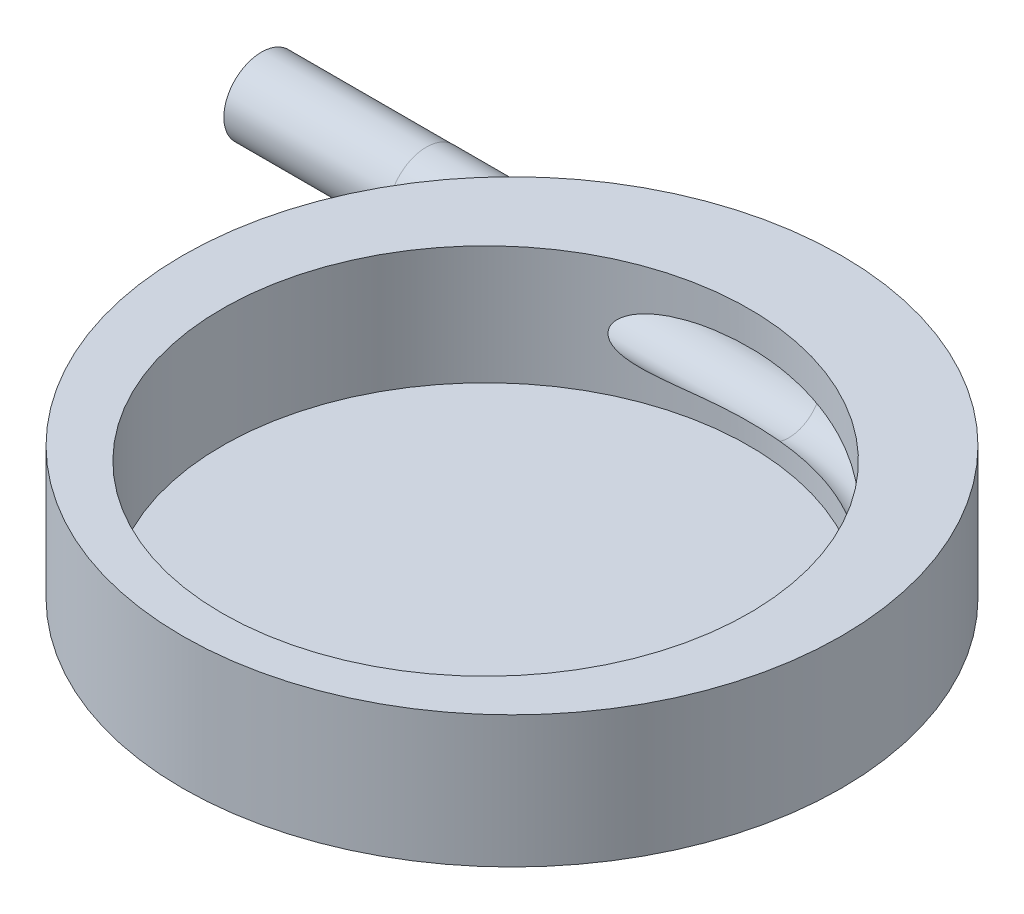
ISO-10303-21;
HEADER;
FILE_DESCRIPTION(('STEP AP214'),'2;1');
FILE_NAME('part.step','',(''),(''),'','','');
FILE_SCHEMA(('AUTOMOTIVE_DESIGN { 1 0 10303 214 1 1 1 1 }'));
ENDSEC;
DATA;
#1=APPLICATION_CONTEXT('core data for automotive mechanical design processes');
#2=APPLICATION_PROTOCOL_DEFINITION('international standard','automotive_design',2000,#1);
#3=PRODUCT_CONTEXT('',#1,'mechanical');
#4=PRODUCT('Part','Part','',(#3));
#5=PRODUCT_RELATED_PRODUCT_CATEGORY('part','',(#4));
#6=PRODUCT_DEFINITION_FORMATION('','',#4);
#7=PRODUCT_DEFINITION_CONTEXT('part definition',#1,'design');
#8=PRODUCT_DEFINITION('design','',#6,#7);
#9=PRODUCT_DEFINITION_SHAPE('','',#8);
#10=(LENGTH_UNIT() NAMED_UNIT(*) SI_UNIT(.MILLI.,.METRE.));
#11=(NAMED_UNIT(*) PLANE_ANGLE_UNIT() SI_UNIT($,.RADIAN.));
#12=(NAMED_UNIT(*) SI_UNIT($,.STERADIAN.) SOLID_ANGLE_UNIT());
#13=UNCERTAINTY_MEASURE_WITH_UNIT(LENGTH_MEASURE(1.E-05),#10,'distance_accuracy_value','');
#14=(GEOMETRIC_REPRESENTATION_CONTEXT(3) GLOBAL_UNCERTAINTY_ASSIGNED_CONTEXT((#13)) GLOBAL_UNIT_ASSIGNED_CONTEXT((#10,
#11,#12)) REPRESENTATION_CONTEXT('',''));
#15=CARTESIAN_POINT('',(0.,0.,0.));
#16=DIRECTION('',(0.,0.,1.));
#17=DIRECTION('',(1.,0.,0.));
#18=AXIS2_PLACEMENT_3D('',#15,#16,#17);
#19=CARTESIAN_POINT('',(0.,20.,4.));
#20=DIRECTION('',(0.,-1.,0.));
#21=DIRECTION('',(0.,0.,-1.));
#22=AXIS2_PLACEMENT_3D('',#19,#20,#21);
#23=CYLINDRICAL_SURFACE('',#22,40.);
#24=CARTESIAN_POINT('',(0.,2.,4.));
#25=DIRECTION('',(0.,1.,0.));
#26=DIRECTION('',(0.,0.,1.));
#27=AXIS2_PLACEMENT_3D('',#24,#25,#26);
#28=CIRCLE('',#27,40.);
#29=CARTESIAN_POINT('',(0.,2.,44.));
#30=VERTEX_POINT('',#29);
#31=EDGE_CURVE('E123',#30,#30,#28,.T.);
#32=ORIENTED_EDGE('',*,*,#31,.F.);
#33=EDGE_LOOP('',(#32));
#34=FACE_BOUND('',#33,.T.);
#35=CARTESIAN_POINT('',(0.,20.,4.));
#36=DIRECTION('',(0.,1.,0.));
#37=DIRECTION('',(0.,0.,1.));
#38=AXIS2_PLACEMENT_3D('',#35,#36,#37);
#39=CIRCLE('',#38,40.);
#40=CARTESIAN_POINT('',(0.,20.,44.));
#41=VERTEX_POINT('',#40);
#42=EDGE_CURVE('E114',#41,#41,#39,.T.);
#43=ORIENTED_EDGE('',*,*,#42,.T.);
#44=EDGE_LOOP('',(#43));
#45=FACE_BOUND('',#44,.T.);
#46=DIRECTION('',(0.,-1.,0.));
#47=VECTOR('',#46,1.);
#48=CARTESIAN_POINT('',(32.6655335644082,20.,27.0859896247165));
#49=LINE('',#48,#47);
#50=CARTESIAN_POINT('',(32.6655335644082,14.2592599935845,27.0859896247165));
#51=VERTEX_POINT('',#50);
#52=CARTESIAN_POINT('',(32.6655335644082,5.84841239569503,27.0859896247165));
#53=VERTEX_POINT('',#52);
#54=EDGE_CURVE('E63',#51,#53,#49,.T.);
#55=ORIENTED_EDGE('',*,*,#54,.T.);
#56=CARTESIAN_POINT('',(31.455499464649,6.09002957114624,28.7093414203913));
#57=CARTESIAN_POINT('',(31.7137638182249,6.03556428410288,28.380573265437));
#58=CARTESIAN_POINT('',(31.9670967603697,5.98402529520093,28.0474569651805));
#59=CARTESIAN_POINT('',(32.4635374641398,5.88632855148393,27.3729328838452));
#60=CARTESIAN_POINT('',(32.7066455089348,5.84017064758154,27.0315253327991));
#61=CARTESIAN_POINT('',(33.182221566403,5.75277402992615,26.3409023687803));
#62=CARTESIAN_POINT('',(33.414692550602,5.71153393711874,25.9916891774395));
#63=CARTESIAN_POINT('',(33.8687459495336,5.63360136379022,25.2857749765452));
#64=CARTESIAN_POINT('',(34.0903282616412,5.59690892612551,24.929073896464));
#65=CARTESIAN_POINT('',(34.7384863356481,5.49315106971563,23.848011000019));
#66=CARTESIAN_POINT('',(35.1483339118309,5.43243026716021,23.1128917883856));
#67=CARTESIAN_POINT('',(35.9212652435493,5.32597487652627,21.6173692515045));
#68=CARTESIAN_POINT('',(36.2843399030624,5.28024320075085,20.8569610443218));
#69=CARTESIAN_POINT('',(37.0653567279209,5.19036818422055,19.0787205143414));
#70=CARTESIAN_POINT('',(37.4662646611111,5.15096237776326,18.0531031300035));
#71=CARTESIAN_POINT('',(38.1823254092484,5.09237225742284,15.9717085025345));
#72=CARTESIAN_POINT('',(38.497464476332,5.07319118394102,14.9159264542526));
#73=CARTESIAN_POINT('',(39.0397201688759,5.05266020746107,12.7814083242282));
#74=CARTESIAN_POINT('',(39.2668048932623,5.05131676098126,11.7026640725723));
#75=CARTESIAN_POINT('',(39.6311643969804,5.06418109151128,9.53026613478107));
#76=CARTESIAN_POINT('',(39.7684427124175,5.07838825616074,8.43661303740898));
#77=CARTESIAN_POINT('',(39.9524259619792,5.12003661492655,6.24044470731463));
#78=CARTESIAN_POINT('',(39.9990050142957,5.14749613621323,5.13791928723124));
#79=CARTESIAN_POINT('',(40.0009634554894,5.21314380968361,2.93310770756898));
#80=CARTESIAN_POINT('',(39.9563419890983,5.25133206247725,1.83082155033083));
#81=CARTESIAN_POINT('',(39.7762750228464,5.33568767524298,-0.366093881108271));
#82=CARTESIAN_POINT('',(39.6408212690112,5.38185576006329,-1.46072245032568));
#83=CARTESIAN_POINT('',(39.2800629060936,5.47911934485887,-3.63485088651306));
#84=CARTESIAN_POINT('',(39.0547573489435,5.53021489682181,-4.71435059372701));
#85=CARTESIAN_POINT('',(38.5113009808996,5.63484177351839,-6.86898255949879));
#86=CARTESIAN_POINT('',(38.19165246158,5.68839961064399,-7.94373605247632));
#87=CARTESIAN_POINT('',(37.4632448095182,5.79329851080853,-10.0627346596424));
#88=CARTESIAN_POINT('',(37.0544844918094,5.84463954435858,-11.1069793679301));
#89=CARTESIAN_POINT('',(36.1506775527344,5.94110999046968,-13.1576181043705));
#90=CARTESIAN_POINT('',(35.6556396395484,5.98624002909765,-14.1640159400365));
#91=CARTESIAN_POINT('',(34.5826307514606,6.06643740246129,-16.1320069928989));
#92=CARTESIAN_POINT('',(34.0046604505075,6.10150481896374,-17.0936005741122));
#93=CARTESIAN_POINT('',(32.7683314587671,6.15836183447038,-18.9673521888536));
#94=CARTESIAN_POINT('',(32.1097855617492,6.18011977982464,-19.8793877061389));
#95=CARTESIAN_POINT('',(30.7180980382736,6.20803150005458,-21.6449198845979));
#96=CARTESIAN_POINT('',(29.9849561252803,6.21418521498944,-22.4984163208923));
#97=CARTESIAN_POINT('',(28.4493280644015,6.21024439426546,-24.1407128015606));
#98=CARTESIAN_POINT('',(27.646833567587,6.20014789975868,-24.9295050342539));
#99=CARTESIAN_POINT('',(25.9784730322324,6.16475404791085,-26.4365331700596));
#100=CARTESIAN_POINT('',(25.1126083384695,6.13945701305796,-27.154770569657));
#101=CARTESIAN_POINT('',(23.3344773074808,6.0765578106227,-28.5074636852177));
#102=CARTESIAN_POINT('',(22.4228879239243,6.03910607215151,-29.1428168406305));
#103=CARTESIAN_POINT('',(20.5502622876816,5.95518842771907,-30.3353897218501));
#104=CARTESIAN_POINT('',(19.5892226326327,5.9087219008958,-30.8926040615628));
#105=CARTESIAN_POINT('',(17.6249559695141,5.8106165425173,-31.9248013636363));
#106=CARTESIAN_POINT('',(16.6217534130229,5.75898068544484,-32.3998311912971));
#107=CARTESIAN_POINT('',(14.5795858366406,5.65437912642343,-33.2647900956908));
#108=CARTESIAN_POINT('',(13.5406311931107,5.60141381151183,-33.6547436270114));
#109=CARTESIAN_POINT('',(11.8784387184349,5.51966449516818,-34.2009681152913));
#110=CARTESIAN_POINT('',(11.2646699187183,5.49010292968124,-34.3864333886334));
#111=CARTESIAN_POINT('',(10.0288784386628,5.43241172436864,-34.7276690724235));
#112=CARTESIAN_POINT('',(9.40685645737923,5.40428196423102,-34.8834419808954));
#113=CARTESIAN_POINT('',(8.15708952890347,5.35013219137862,-35.1646701217404));
#114=CARTESIAN_POINT('',(7.52935684915671,5.32410848468792,-35.2901792370926));
#115=CARTESIAN_POINT('',(6.268346315261,5.27468847471987,-35.5109843806938));
#116=CARTESIAN_POINT('',(5.63506719658455,5.25129278834781,-35.6062733245479));
#117=CARTESIAN_POINT('',(4.9998,5.22950423935838,-35.6862948630884));
#118=B_SPLINE_CURVE_WITH_KNOTS('',3,(#56,#57,#58,#59,#60,#61,#62,#63,#64,#65,#66,#67,#68,#69,
#70,#71,#72,#73,#74,#75,#76,#77,#78,#79,#80,#81,#82,#83,#84,#85,#86,#87,#88,#89,#90,#91,#92,#93,
#94,#95,#96,#97,#98,#99,#100,#101,#102,#103,#104,#105,#106,#107,#108,#109,#110,#111,#112,#113,
#114,#115,#116,#117),.UNSPECIFIED.,.F.,.F.,(4,2,2,2,2,2,2,2,2,2,2,2,2,2,2,2,2,2,2,2,2,2,2,2,2,2,
2,2,2,2,4),(0.,1.26475716847863,2.52947928750017,3.79384591450532,5.05822445580367,
7.58772076199819,10.1177082441748,13.4192477708495,16.7213161889619,20.0245797931958,
23.3277133244072,26.6354280271437,29.9431737493991,33.2512200888683,36.5593013339857,
39.9230164744411,43.2867763467223,46.6501969040165,50.0135901300788,53.3849516590672,
56.7563261385075,60.1281070437581,63.4998164172732,66.8312938591866,70.1630008264626,
73.4928015974218,76.8216439756564,78.7465792193616,80.6713524463751,82.5926729915597,
84.5144436119406),.UNSPECIFIED.);
#119=CARTESIAN_POINT('',(5.,5.22951110096639,-35.6862696659689));
#120=VERTEX_POINT('',#119);
#121=EDGE_CURVE('E11',#53,#120,#118,.T.);
#122=ORIENTED_EDGE('',*,*,#121,.T.);
#123=CARTESIAN_POINT('',(5.,5.22951110096639,-35.6862696659689));
#124=CARTESIAN_POINT('',(4.7918612722749,5.22237349455055,-35.7124927621041));
#125=CARTESIAN_POINT('',(4.58349834277701,5.21590384221301,-35.7370805023517));
#126=CARTESIAN_POINT('',(4.16638049507971,5.20415338378429,-35.782977472494));
#127=CARTESIAN_POINT('',(3.9576255813325,5.19887256427161,-35.8042867394007));
#128=CARTESIAN_POINT('',(3.33087378689882,5.18459308269134,-35.8632837664194));
#129=CARTESIAN_POINT('',(2.91236656806309,5.17715663240526,-35.8960436866062));
#130=CARTESIAN_POINT('',(2.07433213005047,5.16560339205537,-35.9483852745259));
#131=CARTESIAN_POINT('',(1.65480458102505,5.16148787726551,-35.9679618792508));
#132=CARTESIAN_POINT('',(0.815318450886483,5.15608895544674,-35.9938946037448));
#133=CARTESIAN_POINT('',(0.395359866789346,5.15480556815834,-36.0002506313637));
#134=CARTESIAN_POINT('',(-0.447690102028197,5.15491133088943,-35.9997323151337));
#135=CARTESIAN_POINT('',(-0.870781421410384,5.15632054486301,-35.9927586447167));
#136=CARTESIAN_POINT('',(-1.71651176342396,5.16202843935936,-35.9653923717726));
#137=CARTESIAN_POINT('',(-2.13915078582828,5.16632712133199,-35.9449997625125));
#138=CARTESIAN_POINT('',(-2.9834075754426,5.17833555973446,-35.8908280082774));
#139=CARTESIAN_POINT('',(-3.40502558696529,5.18604439751033,-35.8570524687544));
#140=CARTESIAN_POINT('',(-4.2468728140845,5.20574849033043,-35.7761595150725));
#141=CARTESIAN_POINT('',(-4.66710207935587,5.21774359034472,-35.7290425834715));
#142=CARTESIAN_POINT('',(-5.3973265510338,5.2434682497111,-35.6354280330947));
#143=CARTESIAN_POINT('',(-5.70775155643856,5.25594902140529,-35.5919154620549));
#144=CARTESIAN_POINT('',(-6.32732224730613,5.28462957106812,-35.4976350395051));
#145=CARTESIAN_POINT('',(-6.63646796698945,5.30082924889389,-35.4468673833742));
#146=CARTESIAN_POINT('',(-7.25333478897804,5.33775348608345,-35.3381145574421));
#147=CARTESIAN_POINT('',(-7.56105533685159,5.35847967642574,-35.2801267893592));
#148=CARTESIAN_POINT('',(-8.17465209978201,5.40541693344138,-35.1570296574981));
#149=CARTESIAN_POINT('',(-8.48052832900224,5.43162795793884,-35.0919203484833));
#150=CARTESIAN_POINT('',(-9.08964538910527,5.49064836428869,-34.9547899967761));
#151=CARTESIAN_POINT('',(-9.39288929121605,5.52344852748989,-34.8827786832492));
#152=CARTESIAN_POINT('',(-9.9967295616706,5.59705513050567,-34.7319279176206));
#153=CARTESIAN_POINT('',(-10.2973257619661,5.63786207473479,-34.6530880355047));
#154=CARTESIAN_POINT('',(-10.8949911020888,5.72911919742176,-34.4888960329679));
#155=CARTESIAN_POINT('',(-11.192063074432,5.77956098287519,-34.4035496190474));
#156=CARTESIAN_POINT('',(-11.7820832378703,5.89215731199186,-34.2266572267951));
#157=CARTESIAN_POINT('',(-12.0750322226162,5.95430956737891,-34.1351124618827));
#158=CARTESIAN_POINT('',(-12.6575460777073,6.09334033337308,-33.9457627586321));
#159=CARTESIAN_POINT('',(-12.9470779714182,6.17030921082371,-33.8479219932769));
#160=CARTESIAN_POINT('',(-13.519391297943,6.34212491041185,-33.6472831808798));
#161=CARTESIAN_POINT('',(-13.8021685338998,6.43698253769529,-33.5444821658254));
#162=CARTESIAN_POINT('',(-14.2188249701166,6.59588242449453,-33.38779304927));
#163=CARTESIAN_POINT('',(-14.3563820216895,6.65158120889534,-33.3351796772845));
#164=CARTESIAN_POINT('',(-14.6285608357009,6.76922494076743,-33.2293768329191));
#165=CARTESIAN_POINT('',(-14.7631831144992,6.83116877848494,-33.1761874643887));
#166=CARTESIAN_POINT('',(-15.0286871810201,6.96199871224174,-33.0696505626497));
#167=CARTESIAN_POINT('',(-15.1595742024028,7.03087441381201,-33.0163033793333));
#168=CARTESIAN_POINT('',(-15.4170146488159,7.17658013840478,-32.9098233569042));
#169=CARTESIAN_POINT('',(-15.5435669739438,7.25341216068618,-32.8566905751679));
#170=CARTESIAN_POINT('',(-15.792799759924,7.41713741658756,-32.7505925073731));
#171=CARTESIAN_POINT('',(-15.9154077570528,7.50414929453955,-32.6976385389749));
#172=CARTESIAN_POINT('',(-16.1532834742028,7.68857760905998,-32.5935549480195));
#173=CARTESIAN_POINT('',(-16.2685564792744,7.78598641571735,-32.5424240238639));
#174=CARTESIAN_POINT('',(-16.4888890296486,7.99190420344074,-32.4435319158659));
#175=CARTESIAN_POINT('',(-16.5940095561549,8.10033767745195,-32.3957511554212));
#176=CARTESIAN_POINT('',(-16.7916225046507,8.32983335615583,-32.305002430686));
#177=CARTESIAN_POINT('',(-16.884136278057,8.45087358004431,-32.2620263516954));
#178=CARTESIAN_POINT('',(-17.0419774217572,8.6903277615489,-32.1880870856695));
#179=CARTESIAN_POINT('',(-17.1092573897645,8.80717993903787,-32.1562938431099));
#180=CARTESIAN_POINT('',(-17.2275479685499,9.05065217533901,-32.1000816388443));
#181=CARTESIAN_POINT('',(-17.2785612639968,9.17727061802816,-32.0756614603156));
#182=CARTESIAN_POINT('',(-17.3609409631706,9.43957408143645,-32.036091301268));
#183=CARTESIAN_POINT('',(-17.3921259360864,9.57533060252291,-32.0210269556424));
#184=CARTESIAN_POINT('',(-17.4310319022887,9.85091675765361,-32.0022170569013));
#185=CARTESIAN_POINT('',(-17.438774571817,9.99074250814386,-31.9984610473985));
#186=CARTESIAN_POINT('',(-17.4304021198756,10.2571388573262,-32.0025147985362));
#187=CARTESIAN_POINT('',(-17.4163226492954,10.3837950506139,-32.0093377366216));
#188=CARTESIAN_POINT('',(-17.3692942646702,10.6326932230259,-32.0320452044442));
#189=CARTESIAN_POINT('',(-17.336334527821,10.754932627536,-32.0479349315498));
#190=CARTESIAN_POINT('',(-17.2429961523959,11.0242061259957,-32.0926918065307));
#191=CARTESIAN_POINT('',(-17.177637138452,11.1691079372186,-32.1238953694882));
#192=CARTESIAN_POINT('',(-17.026444211952,11.4453558876673,-32.195402323873));
#193=CARTESIAN_POINT('',(-16.9405698347045,11.5766744923309,-32.2357236908308));
#194=CARTESIAN_POINT('',(-16.7751289006932,11.7968538977625,-32.3125512777382));
#195=CARTESIAN_POINT('',(-16.6986493999812,11.8885358867878,-32.3478041558169));
#196=CARTESIAN_POINT('',(-16.5384315173941,12.0642266252201,-32.4209834669588));
#197=CARTESIAN_POINT('',(-16.4546890070312,12.1482309539853,-32.4589114182866));
#198=CARTESIAN_POINT('',(-16.2813202017545,12.3091882465471,-32.5366617427064));
#199=CARTESIAN_POINT('',(-16.1916861069029,12.3861315257466,-32.5764866071371));
#200=CARTESIAN_POINT('',(-16.0077111482297,12.5334902851264,-32.6573772566937));
#201=CARTESIAN_POINT('',(-15.9133684707313,12.6039032195962,-32.6984435175477));
#202=CARTESIAN_POINT('',(-15.6356148278603,12.7985361696873,-32.8180181841585));
#203=CARTESIAN_POINT('',(-15.4473035109042,12.9151957985383,-32.8974835951655));
#204=CARTESIAN_POINT('',(-15.0610654052316,13.1310634162397,-33.056822745545));
#205=CARTESIAN_POINT('',(-14.8631299396533,13.2302552698721,-33.1366967930377));
#206=CARTESIAN_POINT('',(-14.4597740805805,13.4142296798113,-33.2956033196261));
#207=CARTESIAN_POINT('',(-14.254337274472,13.4989780167282,-33.374633395484));
#208=CARTESIAN_POINT('',(-13.8381948053289,13.6560888760679,-33.5307044739247));
#209=CARTESIAN_POINT('',(-13.6274909596636,13.7284556049068,-33.607746144447));
#210=CARTESIAN_POINT('',(-13.1192274438175,13.8888341050218,-33.7886775707424));
#211=CARTESIAN_POINT('',(-12.819719531894,13.9720050714663,-33.8913726383673));
#212=CARTESIAN_POINT('',(-12.2146532849116,14.1222142340456,-34.0907316874047));
#213=CARTESIAN_POINT('',(-11.9090924286439,14.1892455478893,-34.1873930829628));
#214=CARTESIAN_POINT('',(-11.2928931066802,14.3102707070694,-34.3741368619117));
#215=CARTESIAN_POINT('',(-10.982247310329,14.3642435573218,-34.4642084903843));
#216=CARTESIAN_POINT('',(-10.3573661865615,14.4614217919252,-34.6371591745254));
#217=CARTESIAN_POINT('',(-10.0431313715418,14.5046286936987,-34.7200392427446));
#218=CARTESIAN_POINT('',(-9.40971243209263,14.5824747702392,-34.8788452359703));
#219=CARTESIAN_POINT('',(-9.09050953007372,14.6170576041668,-34.9547234902153));
#220=CARTESIAN_POINT('',(-8.44966094013839,14.6789123430077,-35.0987352408136));
#221=CARTESIAN_POINT('',(-8.12801519292251,14.7061840698586,-35.1668685485151));
#222=CARTESIAN_POINT('',(-7.48295294615581,14.7547287988444,-35.2952093861595));
#223=CARTESIAN_POINT('',(-7.15953794412355,14.7760062543278,-35.3554227822492));
#224=CARTESIAN_POINT('',(-6.51104033211895,14.8136851489407,-35.4678941334582));
#225=CARTESIAN_POINT('',(-6.18595765844042,14.8300864003635,-35.5201517822878));
#226=CARTESIAN_POINT('',(-5.40743680755072,14.8645465275591,-35.6354523828349));
#227=CARTESIAN_POINT('',(-4.95335923377814,14.8807595437302,-35.6947593979804));
#228=CARTESIAN_POINT('',(-4.04325935650548,14.9074369931035,-35.7977613441856));
#229=CARTESIAN_POINT('',(-3.5872369530195,14.9179011270695,-35.841455462534));
#230=CARTESIAN_POINT('',(-2.67367787764401,14.9344268153235,-35.9131741555809));
#231=CARTESIAN_POINT('',(-2.21614061925264,14.9404863966115,-35.9411917067376));
#232=CARTESIAN_POINT('',(-1.30034212745737,14.9490432018165,-35.9814856076023));
#233=CARTESIAN_POINT('',(-0.842080894023172,14.9515404255844,-35.9937619566516));
#234=CARTESIAN_POINT('',(0.066187403927446,14.9533222271894,-36.00247583041));
#235=CARTESIAN_POINT('',(0.516191621235743,14.9526649177895,-35.99919987162));
#236=CARTESIAN_POINT('',(1.41581185950042,14.9481747864041,-35.9774677418181));
#237=CARTESIAN_POINT('',(1.86542788377269,14.9443419918174,-35.9590117017824));
#238=CARTESIAN_POINT('',(2.76345409283685,14.9329733611831,-35.9069600994336));
#239=CARTESIAN_POINT('',(3.21186487276616,14.925439941529,-35.873374417493));
#240=CARTESIAN_POINT('',(3.88335161260795,14.9106191580031,-35.811683150875));
#241=CARTESIAN_POINT('',(4.10699929580366,14.9050918922035,-35.7892330550506));
#242=CARTESIAN_POINT('',(4.55385025068135,14.8926852697667,-35.7405706988451));
#243=CARTESIAN_POINT('',(4.77705351641672,14.8858058951585,-35.7143583884617));
#244=CARTESIAN_POINT('',(5.,14.8781612883131,-35.6862696659689));
#245=B_SPLINE_CURVE_WITH_KNOTS('',3,(#123,#124,#125,#126,#127,#128,#129,#130,#131,#132,#133,
#134,#135,#136,#137,#138,#139,#140,#141,#142,#143,#144,#145,#146,#147,#148,#149,#150,#151,#152,
#153,#154,#155,#156,#157,#158,#159,#160,#161,#162,#163,#164,#165,#166,#167,#168,#169,#170,#171,
#172,#173,#174,#175,#176,#177,#178,#179,#180,#181,#182,#183,#184,#185,#186,#187,#188,#189,#190,
#191,#192,#193,#194,#195,#196,#197,#198,#199,#200,#201,#202,#203,#204,#205,#206,#207,#208,#209,
#210,#211,#212,#213,#214,#215,#216,#217,#218,#219,#220,#221,#222,#223,#224,#225,#226,#227,#228,
#229,#230,#231,#232,#233,#234,#235,#236,#237,#238,#239,#240,#241,#242,#243,#244),.UNSPECIFIED.,
.F.,.F.,(4,2,2,2,2,2,2,2,2,2,2,2,2,2,2,2,2,2,2,2,2,2,2,2,2,2,2,2,2,2,2,2,2,2,2,2,2,2,2,2,2,2,2,
2,2,2,2,2,2,2,2,2,2,2,2,2,2,2,2,2,4),(0.,0.629700108842379,1.25939310823305,2.51870869760029,
3.77850764749421,5.03831537841799,6.30754720549763,7.57677966943857,8.84567042580073,
10.1145152922627,11.0555412164073,11.9965418035375,12.9378820100307,13.8792149783101,
14.8192400169535,15.759324294713,16.6985933600902,17.637679078241,18.5826849602734,
19.5282634827762,20.0005105617088,20.4726738691684,20.9441394189301,21.4157237270379,
21.893487407254,22.3709028546284,22.8452444406298,23.3187723993229,23.7331297601592,
24.1474186995825,24.5654458423085,24.9830863323723,25.3640464067593,25.7452250791324,
26.2285365740185,26.7128093440579,27.0857708873576,27.4589458390679,27.8326252002505,
28.2064496251082,28.9112694934263,29.6167370367303,30.3238534056144,31.0307290660733,
32.0121637405294,32.9940161813574,33.9774368842589,34.9607188989586,35.9502656296104,
36.9398364585335,37.9286701510248,38.9175419031803,40.2918695706099,41.6662687666644,
43.041283240072,44.4162977710202,45.7660800885923,47.1158507601331,48.4647412424989,
49.1392288637232,49.8137254501901),.UNSPECIFIED.);
#246=CARTESIAN_POINT('',(5.,14.8781612883131,-35.6862696659689));
#247=VERTEX_POINT('',#246);
#248=EDGE_CURVE('E95',#120,#247,#245,.T.);
#249=ORIENTED_EDGE('',*,*,#248,.T.);
#250=CARTESIAN_POINT('',(4.9998,14.8781681499211,-35.6862948630884));
#251=CARTESIAN_POINT('',(5.83453163203319,14.8495490724872,-35.5811680144738));
#252=CARTESIAN_POINT('',(6.66582411472633,14.8181394518703,-35.4496517915199));
#253=CARTESIAN_POINT('',(8.31814228852175,14.751094499278,-35.1345753227867));
#254=CARTESIAN_POINT('',(9.13917001788232,14.7154600214465,-34.9510255862774));
#255=CARTESIAN_POINT('',(10.7690069579401,14.6412581350124,-34.5322919161974));
#256=CARTESIAN_POINT('',(11.5777982158994,14.6026868394809,-34.2970387476947));
#257=CARTESIAN_POINT('',(13.1789696353166,14.5241389482275,-33.7759685914387));
#258=CARTESIAN_POINT('',(13.9713468291494,14.4841621018492,-33.4901425478331));
#259=CARTESIAN_POINT('',(15.7971654946876,14.3911011821734,-32.7655913789797));
#260=CARTESIAN_POINT('',(16.8230488745312,14.3380838190335,-32.3076414590206));
#261=CARTESIAN_POINT('',(18.832955187396,14.2363183172033,-31.3069476584457));
#262=CARTESIAN_POINT('',(19.8169707935385,14.1875709241923,-30.7641890132857));
#263=CARTESIAN_POINT('',(21.7362251228404,14.0983416702505,-29.5975832656939));
#264=CARTESIAN_POINT('',(22.6714604598615,14.0578603825539,-28.9737305444927));
#265=CARTESIAN_POINT('',(24.4863563591899,13.9888182378536,-27.6493327755268));
#266=CARTESIAN_POINT('',(25.3660198631229,13.9602567494408,-26.948791792533));
#267=CARTESIAN_POINT('',(27.0622351569431,13.9178759290643,-25.4770146008252));
#268=CARTESIAN_POINT('',(27.8788764098546,13.9040353293058,-24.7058821335548));
#269=CARTESIAN_POINT('',(29.4445003719106,13.8924481152477,-23.0976166307321));
#270=CARTESIAN_POINT('',(30.1934824400999,13.8947016533965,-22.2604829700716));
#271=CARTESIAN_POINT('',(31.6183548531988,13.9150678681696,-20.5262945456405));
#272=CARTESIAN_POINT('',(32.2942421229083,13.9331812117465,-19.6292372633657));
#273=CARTESIAN_POINT('',(33.5680486676432,13.9834238624653,-17.7817597728242));
#274=CARTESIAN_POINT('',(34.1659680869006,14.0155531436787,-16.8313396632774));
#275=CARTESIAN_POINT('',(35.2740134062004,14.0903744312552,-14.8938299182937));
#276=CARTESIAN_POINT('',(35.7849671940703,14.1329561555981,-13.9072091975542));
#277=CARTESIAN_POINT('',(36.7229513940983,14.225185371532,-11.895183351073));
#278=CARTESIAN_POINT('',(37.149982380481,14.2748328147734,-10.869778490761));
#279=CARTESIAN_POINT('',(37.9172886448653,14.3773187228365,-8.78713422212834));
#280=CARTESIAN_POINT('',(38.2575615276457,14.4301572757087,-7.72989393579463));
#281=CARTESIAN_POINT('',(38.8490530786807,14.5352403957119,-5.59075295757451));
#282=CARTESIAN_POINT('',(39.1002709817024,14.587484957735,-4.50885205386898));
#283=CARTESIAN_POINT('',(39.5146219800845,14.6885161544123,-2.31338852657617));
#284=CARTESIAN_POINT('',(39.6765553242785,14.7372483853697,-1.19959670480031));
#285=CARTESIAN_POINT('',(39.9060319320995,14.8271600601964,1.03799112861529));
#286=CARTESIAN_POINT('',(39.9735738853708,14.8683393992084,2.16178727891871));
#287=CARTESIAN_POINT('',(40.0137050604424,14.940154048623,4.41160595240465));
#288=CARTESIAN_POINT('',(39.9862786949799,14.9707876272303,5.53762881074484));
#289=CARTESIAN_POINT('',(39.8365524116337,15.0187789557642,7.78361485290329));
#290=CARTESIAN_POINT('',(39.7142552166187,15.0361370866784,8.90357820970514));
#291=CARTESIAN_POINT('',(39.3764706316646,15.0550029091944,11.1237704706212));
#292=CARTESIAN_POINT('',(39.1614523249472,15.0565894314624,12.2240700546775));
#293=CARTESIAN_POINT('',(38.6398439611038,15.0417023155086,14.4027465332666));
#294=CARTESIAN_POINT('',(38.3332460563668,15.025227129225,15.4811215405834));
#295=CARTESIAN_POINT('',(37.6311651326217,14.971745011615,17.6068882132275));
#296=CARTESIAN_POINT('',(37.2357638148488,14.9347569069876,18.654307362657));
#297=CARTESIAN_POINT('',(36.359101879383,14.8374789998123,20.7112110290395));
#298=CARTESIAN_POINT('',(35.8778710661992,14.7771972775823,21.7207085675199));
#299=CARTESIAN_POINT('',(35.0755387287718,14.6639529261559,23.2371058224333));
#300=CARTESIAN_POINT('',(34.7834638213851,14.6205250253856,23.7602950119314));
#301=CARTESIAN_POINT('',(34.1765385126775,14.5252279649368,24.7923630783099));
#302=CARTESIAN_POINT('',(33.8616940826229,14.4733610139566,25.3012456588063));
#303=CARTESIAN_POINT('',(33.2104654646498,14.3603914220624,26.3029446721251));
#304=CARTESIAN_POINT('',(32.8741131422541,14.2993022697897,26.7957833120338));
#305=CARTESIAN_POINT('',(32.3538176120735,14.1998436097767,27.5227411627726));
#306=CARTESIAN_POINT('',(32.177724668329,14.1653796298505,27.7630527577546));
#307=CARTESIAN_POINT('',(31.820419987765,14.0936555698187,28.2394209345242));
#308=CARTESIAN_POINT('',(31.6392081738499,14.0563954475863,28.4754774521379));
#309=CARTESIAN_POINT('',(31.455499464649,14.0176428181333,28.7093414203913));
#310=B_SPLINE_CURVE_WITH_KNOTS('',3,(#250,#251,#252,#253,#254,#255,#256,#257,#258,#259,#260,
#261,#262,#263,#264,#265,#266,#267,#268,#269,#270,#271,#272,#273,#274,#275,#276,#277,#278,#279,
#280,#281,#282,#283,#284,#285,#286,#287,#288,#289,#290,#291,#292,#293,#294,#295,#296,#297,#298,
#299,#300,#301,#302,#303,#304,#305,#306,#307,#308,#309),.UNSPECIFIED.,.F.,.F.,(4,2,2,2,2,2,2,2,
2,2,2,2,2,2,2,2,2,2,2,2,2,2,2,2,2,2,2,2,2,4),(0.,2.52498249535453,5.04945537991397,
7.57732955396576,10.1056568417732,13.475622272907,16.8461750440062,20.2169614753654,
23.5875693285837,26.9533009016413,30.3190643559178,33.6849693575191,37.0508681324783,
40.3826749731359,43.7144590157894,47.0463350325167,50.3782396787436,53.7538883076019,
57.1295837972653,60.5058333700918,63.8819860454406,67.2412552820063,70.600812462673,
73.9572913418034,77.3126069364457,79.1143466614048,80.9156155849012,82.714275001956,
83.6139300384009,84.5135986318428),.UNSPECIFIED.);
#311=EDGE_CURVE('E138',#247,#51,#310,.T.);
#312=ORIENTED_EDGE('',*,*,#311,.T.);
#313=EDGE_LOOP('',(#55,#122,#249,#312));
#314=FACE_BOUND('',#313,.T.);
#315=ADVANCED_FACE('F47',(#34,#45,#314),#23,.F.);
#316=CARTESIAN_POINT('',(0.,20.,0.));
#317=DIRECTION('',(0.,-1.,0.));
#318=DIRECTION('',(0.,0.,-1.));
#319=AXIS2_PLACEMENT_3D('',#316,#317,#318);
#320=CYLINDRICAL_SURFACE('',#319,50.);
#321=CARTESIAN_POINT('',(0.,0.,0.));
#322=DIRECTION('',(0.,1.,0.));
#323=DIRECTION('',(0.,0.,1.));
#324=AXIS2_PLACEMENT_3D('',#321,#322,#323);
#325=CIRCLE('',#324,50.);
#326=CARTESIAN_POINT('',(0.,0.,50.));
#327=VERTEX_POINT('',#326);
#328=EDGE_CURVE('E118',#327,#327,#325,.T.);
#329=ORIENTED_EDGE('',*,*,#328,.T.);
#330=EDGE_LOOP('',(#329));
#331=FACE_BOUND('',#330,.T.);
#332=CARTESIAN_POINT('',(0.,20.,0.));
#333=DIRECTION('',(0.,1.,0.));
#334=DIRECTION('',(0.,0.,1.));
#335=AXIS2_PLACEMENT_3D('',#332,#333,#334);
#336=CIRCLE('',#335,50.);
#337=CARTESIAN_POINT('',(0.,20.,50.));
#338=VERTEX_POINT('',#337);
#339=EDGE_CURVE('E119',#338,#338,#336,.T.);
#340=ORIENTED_EDGE('',*,*,#339,.F.);
#341=EDGE_LOOP('',(#340));
#342=FACE_BOUND('',#341,.T.);
#343=CARTESIAN_POINT('',(-25.9313998850814,10.,-42.75));
#344=CARTESIAN_POINT('',(-25.9313999648408,9.90964926466197,-42.7499999454114));
#345=CARTESIAN_POINT('',(-25.9349218272042,9.81930170049709,-42.7478643449718));
#346=CARTESIAN_POINT('',(-25.9488908599814,9.63933128238093,-42.7393860555707));
#347=CARTESIAN_POINT('',(-25.9593403900974,9.54970868590047,-42.7330419331017));
#348=CARTESIAN_POINT('',(-26.0007025868681,9.28291832884104,-42.7078982661053));
#349=CARTESIAN_POINT('',(-26.0416290427947,9.10778915816608,-42.6829873244671));
#350=CARTESIAN_POINT('',(-26.1592029207523,8.72505611790046,-42.6110530791978));
#351=CARTESIAN_POINT('',(-26.2422038818393,8.52021175776962,-42.5600705156269));
#352=CARTESIAN_POINT('',(-26.434571766625,8.12872235691071,-42.4408548145571));
#353=CARTESIAN_POINT('',(-26.5439918147955,7.94211506371332,-42.3725869054133));
#354=CARTESIAN_POINT('',(-26.756563664341,7.62454365708924,-42.2385921401273));
#355=CARTESIAN_POINT('',(-26.8562190080729,7.49011663347154,-42.1753339583614));
#356=CARTESIAN_POINT('',(-27.0645064963876,7.23195106228907,-42.0419763826645));
#357=CARTESIAN_POINT('',(-27.1731439831495,7.10821896637289,-41.971872912909));
#358=CARTESIAN_POINT('',(-27.3974276024154,6.87054476356121,-41.8258162969276));
#359=CARTESIAN_POINT('',(-27.5130862867144,6.75662112588177,-41.7498526045953));
#360=CARTESIAN_POINT('',(-27.7496936305229,6.53802509219387,-41.5929644575224));
#361=CARTESIAN_POINT('',(-27.8706441273081,6.43335594799085,-41.5120382758652));
#362=CARTESIAN_POINT('',(-28.2043264341089,6.16101964005416,-41.2865652621219));
#363=CARTESIAN_POINT('',(-28.4210066265761,6.00164993772836,-41.1377999703213));
#364=CARTESIAN_POINT('',(-28.8621008598887,5.70549660760232,-40.8295447281798));
#365=CARTESIAN_POINT('',(-29.086520078721,5.56872847076995,-40.6700475267539));
#366=CARTESIAN_POINT('',(-29.5404550607002,5.31603157235553,-40.3415429160773));
#367=CARTESIAN_POINT('',(-29.769975798787,5.20012425453574,-40.1725259526519));
#368=CARTESIAN_POINT('',(-30.2318028559091,4.98835157778752,-39.8261400253698));
#369=CARTESIAN_POINT('',(-30.4641085331646,4.89248169173041,-39.6487729592014));
#370=CARTESIAN_POINT('',(-30.9436468465001,4.71527408811802,-39.2757978427814));
#371=CARTESIAN_POINT('',(-31.190957402123,4.63511522217803,-39.0797297508456));
#372=CARTESIAN_POINT('',(-31.6855060861093,4.49678226887719,-38.6798377583534));
#373=CARTESIAN_POINT('',(-31.9327442018273,4.43861088606552,-38.476012907076));
#374=CARTESIAN_POINT('',(-32.4255640155236,4.34486312132515,-38.0616128954135));
#375=CARTESIAN_POINT('',(-32.671146732656,4.30927128025867,-37.8510424573954));
#376=CARTESIAN_POINT('',(-33.1594405841071,4.26163264956586,-37.4240116677418));
#377=CARTESIAN_POINT('',(-33.4021521622039,4.24958217272446,-37.207552243867));
#378=CARTESIAN_POINT('',(-33.8529811870131,4.25038582568684,-36.7975064178442));
#379=CARTESIAN_POINT('',(-34.0616061127148,4.26029485945089,-36.6044722504096));
#380=CARTESIAN_POINT('',(-34.4745378302437,4.30037289657168,-36.2158338010543));
#381=CARTESIAN_POINT('',(-34.6788444238911,4.33054282768199,-36.020229401844));
#382=CARTESIAN_POINT('',(-35.0817378863032,4.41250709857906,-35.6279468198945));
#383=CARTESIAN_POINT('',(-35.2803296663438,4.46428223935475,-35.4312697431314));
#384=CARTESIAN_POINT('',(-35.6704458344277,4.59097360443474,-35.0384929624356));
#385=CARTESIAN_POINT('',(-35.8619725236614,4.66588221802354,-34.8423930899964));
#386=CARTESIAN_POINT('',(-36.3238906931729,4.88137038371175,-34.3617735915139));
#387=CARTESIAN_POINT('',(-36.5893625069442,5.0362823898708,-34.0787099004912));
#388=CARTESIAN_POINT('',(-37.0945415645594,5.40457193276913,-33.528111363435));
#389=CARTESIAN_POINT('',(-37.3342830298823,5.6178704394132,-33.2605561146556));
#390=CARTESIAN_POINT('',(-37.7317618545004,6.05430132607455,-32.8083015468977));
#391=CARTESIAN_POINT('',(-37.8960777244922,6.2656045636622,-32.6181104307674));
#392=CARTESIAN_POINT('',(-38.122333636876,6.6107826642007,-32.3527633167803));
#393=CARTESIAN_POINT('',(-38.1943797782513,6.73053975129015,-32.2676409936421));
#394=CARTESIAN_POINT('',(-38.3310635254916,6.97923826146797,-32.1051523834971));
#395=CARTESIAN_POINT('',(-38.3957022005549,7.10817835470793,-32.0277849773431));
#396=CARTESIAN_POINT('',(-38.5073876052728,7.35398961015025,-31.8933773218933));
#397=CARTESIAN_POINT('',(-38.5556073734497,7.46962495966024,-31.8350462627419));
#398=CARTESIAN_POINT('',(-38.6457558417747,7.70659339158238,-31.7255509474422));
#399=CARTESIAN_POINT('',(-38.6876856641491,7.82792545252643,-31.6743854129587));
#400=CARTESIAN_POINT('',(-38.7648261270638,8.07570266708108,-31.5799299918115));
#401=CARTESIAN_POINT('',(-38.8000364325746,8.20214807525809,-31.5366404978455));
#402=CARTESIAN_POINT('',(-38.8633212273825,8.45933218539934,-31.4586202523414));
#403=CARTESIAN_POINT('',(-38.8913991040339,8.5900688159243,-31.4238854382291));
#404=CARTESIAN_POINT('',(-38.9402165518943,8.85564298425598,-31.3633712661298));
#405=CARTESIAN_POINT('',(-38.9609196585195,8.99049741550711,-31.3376364196371));
#406=CARTESIAN_POINT('',(-38.9945251773029,9.26265928055222,-31.2958100802264));
#407=CARTESIAN_POINT('',(-39.0074275318282,9.39996673246169,-31.279718658555));
#408=CARTESIAN_POINT('',(-39.0252540021589,9.67587159416594,-31.2574751753137));
#409=CARTESIAN_POINT('',(-39.0301798069902,9.81446872461964,-31.2513210095413));
#410=CARTESIAN_POINT('',(-39.0319892871215,10.0917923201069,-31.249061039907));
#411=CARTESIAN_POINT('',(-39.0288734811725,10.2305187762209,-31.2529545878835));
#412=CARTESIAN_POINT('',(-39.0152215941311,10.4957307006795,-31.269995004503));
#413=CARTESIAN_POINT('',(-39.0053057796663,10.6222990748317,-31.2823683282647));
#414=CARTESIAN_POINT('',(-38.9788302129798,10.8736982314936,-31.3153515462278));
#415=CARTESIAN_POINT('',(-38.9622682132515,10.9985284114167,-31.3359642266814));
#416=CARTESIAN_POINT('',(-38.922694257897,11.2455165749444,-31.3851057663332));
#417=CARTESIAN_POINT('',(-38.8996851165496,11.3676756994804,-31.4136311714482));
#418=CARTESIAN_POINT('',(-38.8474509945788,11.608673683839,-31.4782031675177));
#419=CARTESIAN_POINT('',(-38.8182236458895,11.7275112591618,-31.51425262374));
#420=CARTESIAN_POINT('',(-38.7532204666835,11.9634522812966,-31.594154574693));
#421=CARTESIAN_POINT('',(-38.717328013087,12.0804766758756,-31.6381455698156));
#422=CARTESIAN_POINT('',(-38.6397368277417,12.3097973833634,-31.7328613593531));
#423=CARTESIAN_POINT('',(-38.5980360263253,12.4220919922665,-31.7835885537517));
#424=CARTESIAN_POINT('',(-38.4647806386291,12.7511048115247,-31.944953823391));
#425=CARTESIAN_POINT('',(-38.3650321235398,12.9600987328574,-32.0648262906005));
#426=CARTESIAN_POINT('',(-38.1332663051287,13.3792917073246,-32.3402260348878));
#427=CARTESIAN_POINT('',(-37.9987763699443,13.5863924581484,-32.4983352928856));
#428=CARTESIAN_POINT('',(-37.7102075380449,13.9700479602393,-32.8327427294722));
#429=CARTESIAN_POINT('',(-37.5561154466443,14.146581945523,-33.0090531444919));
#430=CARTESIAN_POINT('',(-37.2698407925968,14.4317205999408,-33.3315786644148));
#431=CARTESIAN_POINT('',(-37.1409053595965,14.5465728024007,-33.4752482996549));
#432=CARTESIAN_POINT('',(-36.8750226640847,14.759075822526,-33.7679104510786));
#433=CARTESIAN_POINT('',(-36.7380721858962,14.8567196722127,-33.9169050942189));
#434=CARTESIAN_POINT('',(-36.4571761218552,15.0356226865234,-34.2186628960666));
#435=CARTESIAN_POINT('',(-36.3132178372094,15.116850620019,-34.3714326288318));
#436=CARTESIAN_POINT('',(-36.0196033303871,15.2635075421177,-34.6790053273243));
#437=CARTESIAN_POINT('',(-35.8699470944843,15.3289364926584,-34.833808297949));
#438=CARTESIAN_POINT('',(-35.5107363029854,15.4658254372397,-35.2004988088683));
#439=CARTESIAN_POINT('',(-35.2991141393888,15.5308911580368,-35.4127603868357));
#440=CARTESIAN_POINT('',(-34.8688401505182,15.6352842611762,-35.8365076153258));
#441=CARTESIAN_POINT('',(-34.6501857503712,15.6746021006605,-36.0479929493073));
#442=CARTESIAN_POINT('',(-34.2073697393455,15.7293055952601,-36.4684676097323));
#443=CARTESIAN_POINT('',(-33.9832051539375,15.7446780224839,-36.6774554933306));
#444=CARTESIAN_POINT('',(-33.5308883574131,15.7529992231354,-37.0914212592432));
#445=CARTESIAN_POINT('',(-33.3027365586396,15.7459503018074,-37.2963995516223));
#446=CARTESIAN_POINT('',(-32.8375966653562,15.7102242102524,-37.7066429594242));
#447=CARTESIAN_POINT('',(-32.6005340256347,15.6809828306715,-37.9117737074367));
#448=CARTESIAN_POINT('',(-32.1246868136795,15.6012081680449,-38.3158183265777));
#449=CARTESIAN_POINT('',(-31.8859021000488,15.5506731165859,-38.5147316798851));
#450=CARTESIAN_POINT('',(-31.4077658680188,15.4289061870448,-38.9056247855497));
#451=CARTESIAN_POINT('',(-31.1684141510674,15.3576654769944,-39.0976015397406));
#452=CARTESIAN_POINT('',(-30.6906081357655,15.1947042940224,-39.473775956945));
#453=CARTESIAN_POINT('',(-30.4521537154758,15.1029867141596,-39.6579747144995));
#454=CARTESIAN_POINT('',(-30.0068824778939,14.9113393204277,-39.9956898461112));
#455=CARTESIAN_POINT('',(-29.7997815650294,14.8138069249173,-40.1501935442409));
#456=CARTESIAN_POINT('',(-29.3887421018261,14.6021702297767,-40.452031401071));
#457=CARTESIAN_POINT('',(-29.1848041132519,14.4880630227811,-40.5993642958849));
#458=CARTESIAN_POINT('',(-28.782242864638,14.2425316488552,-40.8857353545365));
#459=CARTESIAN_POINT('',(-28.5836101130696,14.1111413041895,-41.024788967742));
#460=CARTESIAN_POINT('',(-28.1937972393825,13.8294827577036,-41.2936537676141));
#461=CARTESIAN_POINT('',(-28.0026124727494,13.6792265756419,-41.4234707573162));
#462=CARTESIAN_POINT('',(-27.6178253223178,13.3462473270843,-41.6810845785778));
#463=CARTESIAN_POINT('',(-27.4249994124779,13.1619836866491,-41.8080965164471));
#464=CARTESIAN_POINT('',(-27.1501936445128,12.8651482137785,-41.9866528994439));
#465=CARTESIAN_POINT('',(-27.0610023233049,12.7628033701159,-42.0441749090854));
#466=CARTESIAN_POINT('',(-26.8886419760637,12.5508324696992,-42.1546129680576));
#467=CARTESIAN_POINT('',(-26.8054716699619,12.441207970159,-42.2075299968942));
#468=CARTESIAN_POINT('',(-26.6029790809482,12.1519605228924,-42.3355949745435));
#469=CARTESIAN_POINT('',(-26.4888518907107,11.9669264648522,-42.4070147643303));
#470=CARTESIAN_POINT('',(-26.2860314094435,11.5778384732378,-42.5330328716499));
#471=CARTESIAN_POINT('',(-26.1973021167629,11.3738120110094,-42.5876550081978));
#472=CARTESIAN_POINT('',(-26.0948081913552,11.0694255759207,-42.6504668446068));
#473=CARTESIAN_POINT('',(-26.0669873405297,10.975494769526,-42.6674697079024));
#474=CARTESIAN_POINT('',(-26.0186520543947,10.78510065201,-42.6969618126564));
#475=CARTESIAN_POINT('',(-25.9981334210556,10.6886388303269,-42.7094536475564));
#476=CARTESIAN_POINT('',(-25.9650445576965,10.4939660240114,-42.7295780320103));
#477=CARTESIAN_POINT('',(-25.9524654735222,10.3957571138936,-42.7372159946488));
#478=CARTESIAN_POINT('',(-25.9356434499099,10.1983641393458,-42.7474267920091));
#479=CARTESIAN_POINT('',(-25.9313997975277,10.0991801590447,-42.7500000599233));
#480=CARTESIAN_POINT('',(-25.9313998850814,10.,-42.75));
#481=B_SPLINE_CURVE_WITH_KNOTS('',3,(#343,#344,#345,#346,#347,#348,#349,#350,#351,#352,#353,
#354,#355,#356,#357,#358,#359,#360,#361,#362,#363,#364,#365,#366,#367,#368,#369,#370,#371,#372,
#373,#374,#375,#376,#377,#378,#379,#380,#381,#382,#383,#384,#385,#386,#387,#388,#389,#390,#391,
#392,#393,#394,#395,#396,#397,#398,#399,#400,#401,#402,#403,#404,#405,#406,#407,#408,#409,#410,
#411,#412,#413,#414,#415,#416,#417,#418,#419,#420,#421,#422,#423,#424,#425,#426,#427,#428,#429,
#430,#431,#432,#433,#434,#435,#436,#437,#438,#439,#440,#441,#442,#443,#444,#445,#446,#447,#448,
#449,#450,#451,#452,#453,#454,#455,#456,#457,#458,#459,#460,#461,#462,#463,#464,#465,#466,#467,
#468,#469,#470,#471,#472,#473,#474,#475,#476,#477,#478,#479,#480),.UNSPECIFIED.,.T.,.F.,(4,2,2,
2,2,2,2,2,2,2,2,2,2,2,2,2,2,2,2,2,2,2,2,2,2,2,2,2,2,2,2,2,2,2,2,2,2,2,2,2,2,2,2,2,2,2,2,2,2,2,2,
2,2,2,2,2,2,2,2,2,2,2,2,2,2,2,2,2,4),(0.,0.270946954339464,0.54198624608857,1.08394997466441,
1.76073907725465,2.4389005954184,2.97486427600745,3.51114904917433,4.04842250879071,
4.5858840092359,5.50658360313503,6.42791164462218,7.35018141723899,8.27224259235866,
9.2482668699014,10.2244111633311,11.1998864138992,12.1752088663765,13.0277107559394,
13.8802516845233,14.7320366286013,15.5835416406837,16.8325262646678,18.0798285922315,
19.0607455539177,19.5511589485363,20.0415014671788,20.4556880289093,20.8698006050506,
21.2839338231014,21.6978699905003,22.1138253504867,22.5297837835622,22.945654126362,
23.3614976427244,23.743721773418,24.1260752679654,24.5082621185071,24.8905947777681,
25.2803858493819,25.6703161708577,26.4497001767204,27.3262535892338,28.2034001844731,
28.8764083582739,29.5496884224601,30.2242375812517,30.898788365127,31.8175826504149,
32.7367172731654,33.6563594631571,34.5759071034626,35.5196501835488,36.4634716557908,
37.4076963060173,38.351787636522,39.1797643751347,40.0078865238052,40.8344115395878,
41.6604126086503,42.544534879377,42.9865411795135,43.4284532313997,44.1127739233644,
44.7961197283262,45.0940743579985,45.3918574164114,45.6893077988295,45.986732738688),.UNSPECIFIED.);
#482=CARTESIAN_POINT('',(-25.9313998850814,10.,-42.75));
#483=VERTEX_POINT('',#482);
#484=EDGE_CURVE('E130',#483,#483,#481,.T.);
#485=ORIENTED_EDGE('',*,*,#484,.F.);
#486=EDGE_LOOP('',(#485));
#487=FACE_BOUND('',#486,.T.);
#488=ADVANCED_FACE('F49',(#331,#342,#487),#320,.T.);
#489=CARTESIAN_POINT('',(0.,20.,0.));
#490=DIRECTION('',(0.,1.,0.));
#491=DIRECTION('',(0.,0.,1.));
#492=AXIS2_PLACEMENT_3D('',#489,#490,#491);
#493=PLANE('',#492);
#494=ORIENTED_EDGE('',*,*,#339,.T.);
#495=EDGE_LOOP('',(#494));
#496=FACE_BOUND('',#495,.T.);
#497=ORIENTED_EDGE('',*,*,#42,.F.);
#498=EDGE_LOOP('',(#497));
#499=FACE_BOUND('',#498,.T.);
#500=ADVANCED_FACE('F165',(#496,#499),#493,.T.);
#501=CARTESIAN_POINT('',(0.,0.,0.));
#502=DIRECTION('',(0.,1.,0.));
#503=DIRECTION('',(0.,0.,1.));
#504=AXIS2_PLACEMENT_3D('',#501,#502,#503);
#505=PLANE('',#504);
#506=ORIENTED_EDGE('',*,*,#328,.F.);
#507=EDGE_LOOP('',(#506));
#508=FACE_BOUND('',#507,.T.);
#509=CARTESIAN_POINT('',(0.,0.,4.));
#510=DIRECTION('',(0.,1.,0.));
#511=DIRECTION('',(0.,0.,1.));
#512=AXIS2_PLACEMENT_3D('',#509,#510,#511);
#513=CIRCLE('',#512,40.);
#514=CARTESIAN_POINT('',(0.,0.,44.));
#515=VERTEX_POINT('',#514);
#516=EDGE_CURVE('E100',#515,#515,#513,.T.);
#517=ORIENTED_EDGE('',*,*,#516,.T.);
#518=EDGE_LOOP('',(#517));
#519=FACE_BOUND('',#518,.T.);
#520=ADVANCED_FACE('F154',(#508,#519),#505,.F.);
#521=CARTESIAN_POINT('',(0.,2.,0.));
#522=DIRECTION('',(0.,1.,0.));
#523=DIRECTION('',(0.,0.,1.));
#524=AXIS2_PLACEMENT_3D('',#521,#522,#523);
#525=PLANE('',#524);
#526=ORIENTED_EDGE('',*,*,#31,.T.);
#527=EDGE_LOOP('',(#526));
#528=FACE_BOUND('',#527,.T.);
#529=ADVANCED_FACE('F150',(#528),#525,.T.);
#530=CARTESIAN_POINT('',(0.,-4.,4.));
#531=DIRECTION('',(0.,1.,0.));
#532=DIRECTION('',(0.,0.,1.));
#533=AXIS2_PLACEMENT_3D('',#530,#531,#532);
#534=CYLINDRICAL_SURFACE('',#533,40.);
#535=CARTESIAN_POINT('',(0.,-4.,4.));
#536=DIRECTION('',(0.,1.,0.));
#537=DIRECTION('',(0.,0.,1.));
#538=AXIS2_PLACEMENT_3D('',#535,#536,#537);
#539=CIRCLE('',#538,40.);
#540=CARTESIAN_POINT('',(0.,-4.,44.));
#541=VERTEX_POINT('',#540);
#542=EDGE_CURVE('E94',#541,#541,#539,.T.);
#543=ORIENTED_EDGE('',*,*,#542,.T.);
#544=EDGE_LOOP('',(#543));
#545=FACE_BOUND('',#544,.T.);
#546=ORIENTED_EDGE('',*,*,#516,.F.);
#547=EDGE_LOOP('',(#546));
#548=FACE_BOUND('',#547,.T.);
#549=ADVANCED_FACE('F153',(#545,#548),#534,.T.);
#550=CARTESIAN_POINT('',(0.,-4.,0.));
#551=DIRECTION('',(0.,1.,0.));
#552=DIRECTION('',(0.,0.,1.));
#553=AXIS2_PLACEMENT_3D('',#550,#551,#552);
#554=PLANE('',#553);
#555=ORIENTED_EDGE('',*,*,#542,.F.);
#556=EDGE_LOOP('',(#555));
#557=FACE_BOUND('',#556,.T.);
#558=ADVANCED_FACE('F148',(#557),#554,.F.);
#559=CARTESIAN_POINT('',(-50.,10.,-37.));
#560=DIRECTION('',(1.,0.,0.));
#561=DIRECTION('',(0.,0.,-1.));
#562=AXIS2_PLACEMENT_3D('',#559,#560,#561);
#563=CYLINDRICAL_SURFACE('',#562,5.75);
#564=CARTESIAN_POINT('',(-50.,10.,-37.));
#565=DIRECTION('',(-1.,0.,0.));
#566=DIRECTION('',(0.,0.,1.));
#567=AXIS2_PLACEMENT_3D('',#564,#565,#566);
#568=CIRCLE('',#567,5.75);
#569=CARTESIAN_POINT('',(-50.,15.3810373515593,-34.9734420755569));
#570=VERTEX_POINT('',#569);
#571=EDGE_CURVE('E88',#570,#570,#568,.T.);
#572=ORIENTED_EDGE('',*,*,#571,.F.);
#573=EDGE_LOOP('',(#572));
#574=FACE_BOUND('',#573,.T.);
#575=ORIENTED_EDGE('',*,*,#484,.T.);
#576=EDGE_LOOP('',(#575));
#577=FACE_BOUND('',#576,.T.);
#578=ADVANCED_FACE('F89',(#574,#577),#563,.T.);
#579=CARTESIAN_POINT('',(-50.,10.,-37.));
#580=DIRECTION('',(-1.,0.,0.));
#581=DIRECTION('',(0.,0.,1.));
#582=AXIS2_PLACEMENT_3D('',#579,#580,#581);
#583=PLANE('',#582);
#584=ORIENTED_EDGE('',*,*,#571,.T.);
#585=CARTESIAN_POINT('',(-50.,10.0295753594201,-36.9888615939483));
#586=DIRECTION('',(-1.,0.,0.));
#587=DIRECTION('',(0.,0.,1.));
#588=AXIS2_PLACEMENT_3D('',#585,#586,#587);
#589=CIRCLE('',#588,5.7183967410826);
#590=EDGE_CURVE('E205',#570,#570,#589,.T.);
#591=ORIENTED_EDGE('',*,*,#590,.F.);
#592=EDGE_LOOP('',(#584,#591));
#593=FACE_BOUND('',#592,.T.);
#594=ADVANCED_FACE('F147',(#593),#583,.T.);
#595=CARTESIAN_POINT('',(30.7531514541503,10.0538361946397,25.1736075144585));
#596=DIRECTION('',(0.707106781186551,0.,-0.707106781186544));
#597=DIRECTION('',(-0.707106781186544,0.,-0.707106781186551));
#598=AXIS2_PLACEMENT_3D('',#595,#596,#597);
#599=PLANE('',#598);
#600=CARTESIAN_POINT('',(30.7531514541503,10.0538361946397,25.1736075144585));
#601=DIRECTION('',(0.707106781186551,0.,-0.707106781186544));
#602=DIRECTION('',(-0.707106781186544,0.,-0.707106781186551));
#603=AXIS2_PLACEMENT_3D('',#600,#601,#602);
#604=CIRCLE('',#603,5.);
#605=EDGE_CURVE('E75',#51,#53,#604,.T.);
#606=ORIENTED_EDGE('',*,*,#605,.T.);
#607=ORIENTED_EDGE('',*,*,#54,.F.);
#608=EDGE_LOOP('',(#606,#607));
#609=FACE_BOUND('',#608,.T.);
#610=ADVANCED_FACE('F193',(#609),#599,.T.);
#611=CARTESIAN_POINT('',(-50.,10.0538361946397,-37.));
#612=DIRECTION('',(1.,0.,0.));
#613=DIRECTION('',(0.,0.,-1.));
#614=AXIS2_PLACEMENT_3D('',#611,#612,#613);
#615=CYLINDRICAL_SURFACE('',#614,5.);
#616=CARTESIAN_POINT('',(5.,10.0538361946397,-37.));
#617=DIRECTION('',(-1.,0.,0.));
#618=DIRECTION('',(0.,0.,1.));
#619=AXIS2_PLACEMENT_3D('',#616,#617,#618);
#620=CIRCLE('',#619,5.);
#621=EDGE_CURVE('E195',#247,#120,#620,.T.);
#622=ORIENTED_EDGE('',*,*,#621,.F.);
#623=ORIENTED_EDGE('',*,*,#248,.F.);
#624=EDGE_LOOP('',(#622,#623));
#625=FACE_BOUND('',#624,.T.);
#626=CARTESIAN_POINT('',(-50.,10.0538361946397,-37.));
#627=DIRECTION('',(-1.,0.,0.));
#628=DIRECTION('',(0.,0.,1.));
#629=AXIS2_PLACEMENT_3D('',#626,#627,#628);
#630=CIRCLE('',#629,5.);
#631=CARTESIAN_POINT('',(-50.,5.50985073708473,-34.9138082155448));
#632=VERTEX_POINT('',#631);
#633=EDGE_CURVE('E198',#632,#632,#630,.T.);
#634=ORIENTED_EDGE('',*,*,#633,.T.);
#635=EDGE_LOOP('',(#634));
#636=FACE_BOUND('',#635,.T.);
#637=ADVANCED_FACE('F237',(#625,#636),#615,.F.);
#638=CARTESIAN_POINT('',(5.,10.0538361946397,-0.579543939692048));
#639=DIRECTION('',(0.,-1.,0.));
#640=DIRECTION('',(0.,0.,-1.));
#641=AXIS2_PLACEMENT_3D('',#638,#639,#640);
#642=TOROIDAL_SURFACE('',#641,36.4204560603079,5.);
#643=ORIENTED_EDGE('',*,*,#605,.F.);
#644=ORIENTED_EDGE('',*,*,#311,.F.);
#645=ORIENTED_EDGE('',*,*,#621,.T.);
#646=ORIENTED_EDGE('',*,*,#121,.F.);
#647=EDGE_LOOP('',(#643,#644,#645,#646));
#648=FACE_BOUND('',#647,.T.);
#649=ADVANCED_FACE('F233',(#648),#642,.F.);
#650=CARTESIAN_POINT('',(-50.,10.0295753594201,-36.9888615939483));
#651=DIRECTION('',(-1.,0.,0.));
#652=DIRECTION('',(0.,0.,1.));
#653=AXIS2_PLACEMENT_3D('',#650,#651,#652);
#654=PLANE('',#653);
#655=CARTESIAN_POINT('',(-50.,10.0295753594201,-36.9888615939483));
#656=DIRECTION('',(-1.,0.,0.));
#657=DIRECTION('',(0.,0.,1.));
#658=AXIS2_PLACEMENT_3D('',#655,#656,#657);
#659=CIRCLE('',#658,4.97330445327556);
#660=EDGE_CURVE('E68',#632,#632,#659,.T.);
#661=ORIENTED_EDGE('',*,*,#660,.T.);
#662=ORIENTED_EDGE('',*,*,#633,.F.);
#663=EDGE_LOOP('',(#661,#662));
#664=FACE_BOUND('',#663,.T.);
#665=ADVANCED_FACE('F224',(#664),#654,.F.);
#666=CARTESIAN_POINT('',(-75.,10.0295753594201,-36.9888615939483));
#667=DIRECTION('',(-1.,0.,0.));
#668=DIRECTION('',(0.,0.,1.));
#669=AXIS2_PLACEMENT_3D('',#666,#667,#668);
#670=PLANE('',#669);
#671=CARTESIAN_POINT('',(-75.,10.0295753594201,-36.9888615939483));
#672=DIRECTION('',(-1.,0.,0.));
#673=DIRECTION('',(0.,0.,1.));
#674=AXIS2_PLACEMENT_3D('',#671,#672,#673);
#675=CIRCLE('',#674,5.7183967410826);
#676=CARTESIAN_POINT('',(-75.,10.0295753594201,-31.2704648528657));
#677=VERTEX_POINT('',#676);
#678=EDGE_CURVE('E204',#677,#677,#675,.T.);
#679=ORIENTED_EDGE('',*,*,#678,.T.);
#680=EDGE_LOOP('',(#679));
#681=FACE_BOUND('',#680,.T.);
#682=CARTESIAN_POINT('',(-75.,10.0295753594201,-36.9888615939483));
#683=DIRECTION('',(-1.,0.,0.));
#684=DIRECTION('',(0.,0.,1.));
#685=AXIS2_PLACEMENT_3D('',#682,#683,#684);
#686=CIRCLE('',#685,4.97330445327556);
#687=CARTESIAN_POINT('',(-75.,10.0295753594201,-32.0155571406727));
#688=VERTEX_POINT('',#687);
#689=EDGE_CURVE('E209',#688,#688,#686,.T.);
#690=ORIENTED_EDGE('',*,*,#689,.F.);
#691=EDGE_LOOP('',(#690));
#692=FACE_BOUND('',#691,.T.);
#693=ADVANCED_FACE('F221',(#681,#692),#670,.T.);
#694=CARTESIAN_POINT('',(-75.,10.0295753594201,-36.9888615939483));
#695=DIRECTION('',(1.,0.,0.));
#696=DIRECTION('',(0.,0.,-1.));
#697=AXIS2_PLACEMENT_3D('',#694,#695,#696);
#698=CYLINDRICAL_SURFACE('',#697,5.7183967410826);
#699=ORIENTED_EDGE('',*,*,#678,.F.);
#700=EDGE_LOOP('',(#699));
#701=FACE_BOUND('',#700,.T.);
#702=ORIENTED_EDGE('',*,*,#590,.T.);
#703=EDGE_LOOP('',(#702));
#704=FACE_BOUND('',#703,.T.);
#705=ADVANCED_FACE('F223',(#701,#704),#698,.T.);
#706=CARTESIAN_POINT('',(-75.,10.0295753594201,-36.9888615939483));
#707=DIRECTION('',(1.,0.,0.));
#708=DIRECTION('',(0.,0.,-1.));
#709=AXIS2_PLACEMENT_3D('',#706,#707,#708);
#710=CYLINDRICAL_SURFACE('',#709,4.97330445327556);
#711=ORIENTED_EDGE('',*,*,#689,.T.);
#712=EDGE_LOOP('',(#711));
#713=FACE_BOUND('',#712,.T.);
#714=ORIENTED_EDGE('',*,*,#660,.F.);
#715=EDGE_LOOP('',(#714));
#716=FACE_BOUND('',#715,.T.);
#717=ADVANCED_FACE('F219',(#713,#716),#710,.F.);
#718=CLOSED_SHELL('',(#315,#488,#500,#520,#529,#549,#558,#578,#594,#610,#637,#649,#665,#693,
#705,#717));
#719=MANIFOLD_SOLID_BREP('B2',#718);
#720=ADVANCED_BREP_SHAPE_REPRESENTATION('',(#18,#719),#14);
#721=SHAPE_DEFINITION_REPRESENTATION(#9,#720);
ENDSEC;
END-ISO-10303-21;
